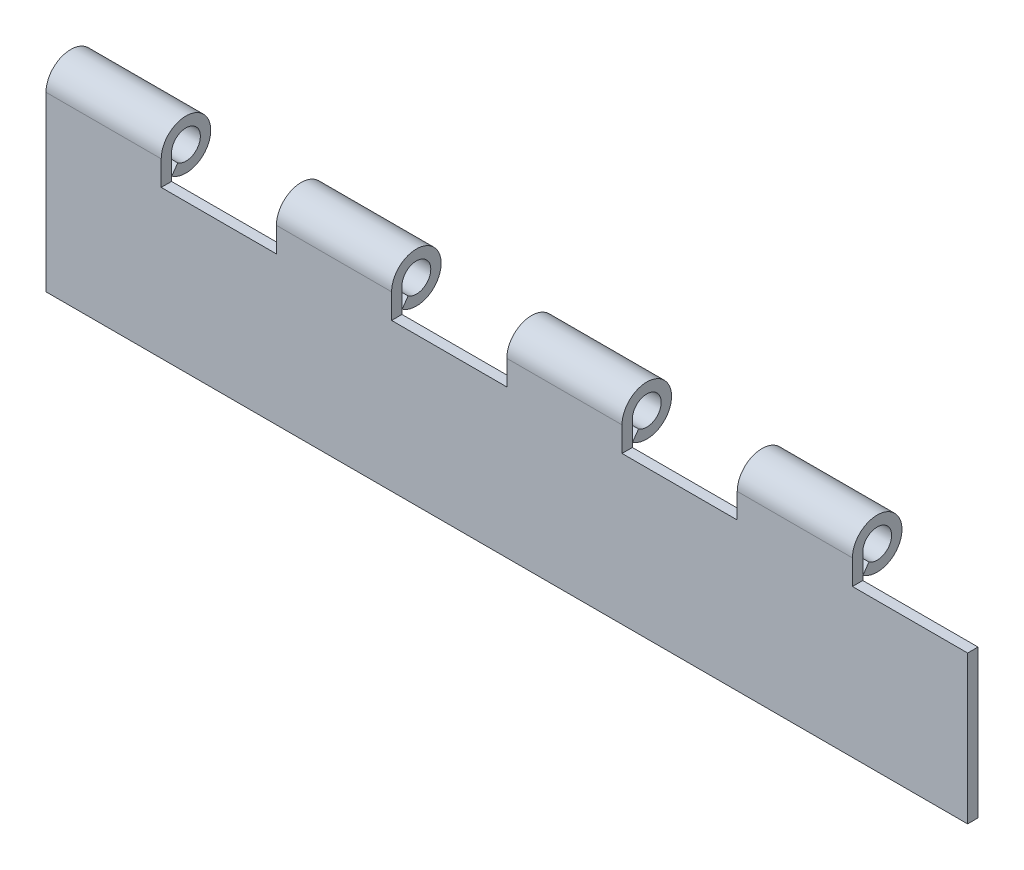
ISO-10303-21;
HEADER;
FILE_DESCRIPTION(('STEP AP214'),'2;1');
FILE_NAME('part.step','',(''),(''),'','','');
FILE_SCHEMA(('AUTOMOTIVE_DESIGN { 1 0 10303 214 1 1 1 1 }'));
ENDSEC;
DATA;
#1=APPLICATION_CONTEXT('core data for automotive mechanical design processes');
#2=APPLICATION_PROTOCOL_DEFINITION('international standard','automotive_design',2000,#1);
#3=PRODUCT_CONTEXT('',#1,'mechanical');
#4=PRODUCT('Part','Part','',(#3));
#5=PRODUCT_RELATED_PRODUCT_CATEGORY('part','',(#4));
#6=PRODUCT_DEFINITION_FORMATION('','',#4);
#7=PRODUCT_DEFINITION_CONTEXT('part definition',#1,'design');
#8=PRODUCT_DEFINITION('design','',#6,#7);
#9=PRODUCT_DEFINITION_SHAPE('','',#8);
#10=(LENGTH_UNIT() NAMED_UNIT(*) SI_UNIT(.MILLI.,.METRE.));
#11=(NAMED_UNIT(*) PLANE_ANGLE_UNIT() SI_UNIT($,.RADIAN.));
#12=(NAMED_UNIT(*) SI_UNIT($,.STERADIAN.) SOLID_ANGLE_UNIT());
#13=UNCERTAINTY_MEASURE_WITH_UNIT(LENGTH_MEASURE(1.E-05),#10,'distance_accuracy_value','');
#14=(GEOMETRIC_REPRESENTATION_CONTEXT(3) GLOBAL_UNCERTAINTY_ASSIGNED_CONTEXT((#13)) GLOBAL_UNIT_ASSIGNED_CONTEXT((#10,
#11,#12)) REPRESENTATION_CONTEXT('',''));
#15=CARTESIAN_POINT('',(0.,0.,0.));
#16=DIRECTION('',(0.,0.,1.));
#17=DIRECTION('',(1.,0.,0.));
#18=AXIS2_PLACEMENT_3D('',#15,#16,#17);
#19=CARTESIAN_POINT('',(-101.6,0.,-5.461));
#20=DIRECTION('',(1.,0.,0.));
#21=DIRECTION('',(0.,0.,-1.));
#22=AXIS2_PLACEMENT_3D('',#19,#20,#21);
#23=CYLINDRICAL_SURFACE('',#22,3.175);
#24=CARTESIAN_POINT('',(-101.6,0.,-5.461));
#25=DIRECTION('',(1.,0.,0.));
#26=DIRECTION('',(0.,0.,-1.));
#27=AXIS2_PLACEMENT_3D('',#24,#25,#26);
#28=CIRCLE('',#27,3.175);
#29=CARTESIAN_POINT('',(-101.6,0.,-2.286));
#30=VERTEX_POINT('',#29);
#31=CARTESIAN_POINT('',(-101.6,-2.60080774061703,-3.63989481458488));
#32=VERTEX_POINT('',#31);
#33=EDGE_CURVE('E266',#30,#32,#28,.F.);
#34=ORIENTED_EDGE('',*,*,#33,.T.);
#35=DIRECTION('',(1.,0.,0.));
#36=VECTOR('',#35,1.);
#37=CARTESIAN_POINT('',(-101.6,-2.60080774061694,-3.63989481458494));
#38=LINE('',#37,#36);
#39=CARTESIAN_POINT('',(-76.2,-2.60080774061703,-3.63989481458488));
#40=VERTEX_POINT('',#39);
#41=EDGE_CURVE('E143',#40,#32,#38,.F.);
#42=ORIENTED_EDGE('',*,*,#41,.F.);
#43=CARTESIAN_POINT('',(-76.2,0.,-5.461));
#44=DIRECTION('',(1.,0.,0.));
#45=DIRECTION('',(0.,0.,-1.));
#46=AXIS2_PLACEMENT_3D('',#43,#44,#45);
#47=CIRCLE('',#46,3.175);
#48=CARTESIAN_POINT('',(-76.2,0.,-2.286));
#49=VERTEX_POINT('',#48);
#50=EDGE_CURVE('E19',#40,#49,#47,.T.);
#51=ORIENTED_EDGE('',*,*,#50,.T.);
#52=DIRECTION('',(-1.,0.,0.));
#53=VECTOR('',#52,1.);
#54=CARTESIAN_POINT('',(-101.6,0.,-2.286));
#55=LINE('',#54,#53);
#56=EDGE_CURVE('E224',#30,#49,#55,.F.);
#57=ORIENTED_EDGE('',*,*,#56,.F.);
#58=EDGE_LOOP('',(#34,#42,#51,#57));
#59=FACE_BOUND('',#58,.T.);
#60=ADVANCED_FACE('F16',(#59),#23,.F.);
#61=CARTESIAN_POINT('',(-101.6,-2.60080774061694,-3.63989481458494));
#62=DIRECTION('',(0.,0.573576436351011,0.819152044289016));
#63=DIRECTION('',(0.,-0.819152044289016,0.573576436351011));
#64=AXIS2_PLACEMENT_3D('',#61,#62,#63);
#65=PLANE('',#64);
#66=DIRECTION('',(1.,0.,0.));
#67=VECTOR('',#66,1.);
#68=CARTESIAN_POINT('',(-101.6,-4.47338931386185,-2.32869908108645));
#69=LINE('',#68,#67);
#70=CARTESIAN_POINT('',(-76.2,-4.47338931386185,-2.32869908108645));
#71=VERTEX_POINT('',#70);
#72=CARTESIAN_POINT('',(-101.6,-4.47338931386185,-2.32869908108645));
#73=VERTEX_POINT('',#72);
#74=EDGE_CURVE('E270',#71,#73,#69,.F.);
#75=ORIENTED_EDGE('',*,*,#74,.F.);
#76=DIRECTION('',(0.,0.819152044289032,-0.573576436350989));
#77=VECTOR('',#76,1.);
#78=CARTESIAN_POINT('',(-76.2,-4.47338931386134,-2.32869908108681));
#79=LINE('',#78,#77);
#80=EDGE_CURVE('E278',#71,#40,#79,.T.);
#81=ORIENTED_EDGE('',*,*,#80,.T.);
#82=ORIENTED_EDGE('',*,*,#41,.T.);
#83=DIRECTION('',(0.,-0.819152044289032,0.573576436350989));
#84=VECTOR('',#83,1.);
#85=CARTESIAN_POINT('',(-101.6,-2.60080774061694,-3.63989481458494));
#86=LINE('',#85,#84);
#87=EDGE_CURVE('E265',#32,#73,#86,.T.);
#88=ORIENTED_EDGE('',*,*,#87,.T.);
#89=EDGE_LOOP('',(#75,#81,#82,#88));
#90=FACE_BOUND('',#89,.T.);
#91=ADVANCED_FACE('F595',(#90),#65,.T.);
#92=CARTESIAN_POINT('',(-101.6,0.,-5.461));
#93=DIRECTION('',(1.,0.,0.));
#94=DIRECTION('',(0.,0.,-1.));
#95=AXIS2_PLACEMENT_3D('',#92,#93,#94);
#96=CYLINDRICAL_SURFACE('',#95,3.175);
#97=CARTESIAN_POINT('',(76.2,0.,-5.461));
#98=DIRECTION('',(1.,0.,0.));
#99=DIRECTION('',(0.,0.,-1.));
#100=AXIS2_PLACEMENT_3D('',#97,#98,#99);
#101=CIRCLE('',#100,3.175);
#102=CARTESIAN_POINT('',(76.2,-2.60080774061703,-3.63989481458488));
#103=VERTEX_POINT('',#102);
#104=CARTESIAN_POINT('',(76.2,0.,-2.286));
#105=VERTEX_POINT('',#104);
#106=EDGE_CURVE('E258',#103,#105,#101,.T.);
#107=ORIENTED_EDGE('',*,*,#106,.T.);
#108=DIRECTION('',(-1.,0.,0.));
#109=VECTOR('',#108,1.);
#110=CARTESIAN_POINT('',(-101.6,0.,-2.286));
#111=LINE('',#110,#109);
#112=CARTESIAN_POINT('',(50.8,0.,-2.286));
#113=VERTEX_POINT('',#112);
#114=EDGE_CURVE('E297',#113,#105,#111,.F.);
#115=ORIENTED_EDGE('',*,*,#114,.F.);
#116=CARTESIAN_POINT('',(50.8,0.,-5.461));
#117=DIRECTION('',(1.,0.,0.));
#118=DIRECTION('',(0.,0.,-1.));
#119=AXIS2_PLACEMENT_3D('',#116,#117,#118);
#120=CIRCLE('',#119,3.175);
#121=CARTESIAN_POINT('',(50.8,-2.60080774061703,-3.63989481458488));
#122=VERTEX_POINT('',#121);
#123=EDGE_CURVE('E251',#113,#122,#120,.F.);
#124=ORIENTED_EDGE('',*,*,#123,.T.);
#125=DIRECTION('',(1.,0.,0.));
#126=VECTOR('',#125,1.);
#127=CARTESIAN_POINT('',(-101.6,-2.60080774061694,-3.63989481458494));
#128=LINE('',#127,#126);
#129=EDGE_CURVE('E282',#103,#122,#128,.F.);
#130=ORIENTED_EDGE('',*,*,#129,.F.);
#131=EDGE_LOOP('',(#107,#115,#124,#130));
#132=FACE_BOUND('',#131,.T.);
#133=ADVANCED_FACE('F585',(#132),#96,.F.);
#134=CARTESIAN_POINT('',(-101.6,-2.60080774061694,-3.63989481458494));
#135=DIRECTION('',(0.,0.573576436351011,0.819152044289016));
#136=DIRECTION('',(0.,-0.819152044289016,0.573576436351011));
#137=AXIS2_PLACEMENT_3D('',#134,#135,#136);
#138=PLANE('',#137);
#139=ORIENTED_EDGE('',*,*,#129,.T.);
#140=DIRECTION('',(0.,-0.819152044289032,0.573576436350989));
#141=VECTOR('',#140,1.);
#142=CARTESIAN_POINT('',(50.8,-2.60080774061694,-3.63989481458494));
#143=LINE('',#142,#141);
#144=CARTESIAN_POINT('',(50.8,-4.47338931386185,-2.32869908108645));
#145=VERTEX_POINT('',#144);
#146=EDGE_CURVE('E250',#122,#145,#143,.T.);
#147=ORIENTED_EDGE('',*,*,#146,.T.);
#148=DIRECTION('',(1.,0.,0.));
#149=VECTOR('',#148,1.);
#150=CARTESIAN_POINT('',(-101.6,-4.47338931386185,-2.32869908108645));
#151=LINE('',#150,#149);
#152=CARTESIAN_POINT('',(76.2,-4.47338931386185,-2.32869908108645));
#153=VERTEX_POINT('',#152);
#154=EDGE_CURVE('E257',#153,#145,#151,.F.);
#155=ORIENTED_EDGE('',*,*,#154,.F.);
#156=DIRECTION('',(0.,0.819152044289032,-0.573576436350989));
#157=VECTOR('',#156,1.);
#158=CARTESIAN_POINT('',(76.2,-4.47338931386134,-2.32869908108681));
#159=LINE('',#158,#157);
#160=EDGE_CURVE('E261',#153,#103,#159,.T.);
#161=ORIENTED_EDGE('',*,*,#160,.T.);
#162=EDGE_LOOP('',(#139,#147,#155,#161));
#163=FACE_BOUND('',#162,.T.);
#164=ADVANCED_FACE('F587',(#163),#138,.T.);
#165=CARTESIAN_POINT('',(-101.6,0.,-5.461));
#166=DIRECTION('',(1.,0.,0.));
#167=DIRECTION('',(0.,0.,-1.));
#168=AXIS2_PLACEMENT_3D('',#165,#166,#167);
#169=CYLINDRICAL_SURFACE('',#168,3.175);
#170=CARTESIAN_POINT('',(25.4,0.,-5.461));
#171=DIRECTION('',(1.,0.,0.));
#172=DIRECTION('',(0.,0.,-1.));
#173=AXIS2_PLACEMENT_3D('',#170,#171,#172);
#174=CIRCLE('',#173,3.175);
#175=CARTESIAN_POINT('',(25.4,-2.60080774061703,-3.63989481458488));
#176=VERTEX_POINT('',#175);
#177=CARTESIAN_POINT('',(25.4,0.,-2.286));
#178=VERTEX_POINT('',#177);
#179=EDGE_CURVE('E243',#176,#178,#174,.T.);
#180=ORIENTED_EDGE('',*,*,#179,.T.);
#181=DIRECTION('',(-1.,0.,0.));
#182=VECTOR('',#181,1.);
#183=CARTESIAN_POINT('',(-101.6,0.,-2.286));
#184=LINE('',#183,#182);
#185=CARTESIAN_POINT('',(0.,0.,-2.286));
#186=VERTEX_POINT('',#185);
#187=EDGE_CURVE('E292',#186,#178,#184,.F.);
#188=ORIENTED_EDGE('',*,*,#187,.F.);
#189=CARTESIAN_POINT('',(0.,0.,-5.461));
#190=DIRECTION('',(1.,0.,0.));
#191=DIRECTION('',(0.,0.,-1.));
#192=AXIS2_PLACEMENT_3D('',#189,#190,#191);
#193=CIRCLE('',#192,3.175);
#194=CARTESIAN_POINT('',(0.,-2.60080774061703,-3.63989481458488));
#195=VERTEX_POINT('',#194);
#196=EDGE_CURVE('E236',#186,#195,#193,.F.);
#197=ORIENTED_EDGE('',*,*,#196,.T.);
#198=DIRECTION('',(1.,0.,0.));
#199=VECTOR('',#198,1.);
#200=CARTESIAN_POINT('',(-101.6,-2.60080774061694,-3.63989481458494));
#201=LINE('',#200,#199);
#202=EDGE_CURVE('E286',#176,#195,#201,.F.);
#203=ORIENTED_EDGE('',*,*,#202,.F.);
#204=EDGE_LOOP('',(#180,#188,#197,#203));
#205=FACE_BOUND('',#204,.T.);
#206=ADVANCED_FACE('F535',(#205),#169,.F.);
#207=CARTESIAN_POINT('',(-101.6,-2.60080774061694,-3.63989481458494));
#208=DIRECTION('',(0.,0.573576436351011,0.819152044289016));
#209=DIRECTION('',(0.,-0.819152044289016,0.573576436351011));
#210=AXIS2_PLACEMENT_3D('',#207,#208,#209);
#211=PLANE('',#210);
#212=ORIENTED_EDGE('',*,*,#202,.T.);
#213=DIRECTION('',(0.,-0.819152044289032,0.573576436350989));
#214=VECTOR('',#213,1.);
#215=CARTESIAN_POINT('',(0.,-2.60080774061694,-3.63989481458494));
#216=LINE('',#215,#214);
#217=CARTESIAN_POINT('',(0.,-4.47338931386185,-2.32869908108645));
#218=VERTEX_POINT('',#217);
#219=EDGE_CURVE('E235',#195,#218,#216,.T.);
#220=ORIENTED_EDGE('',*,*,#219,.T.);
#221=DIRECTION('',(1.,0.,0.));
#222=VECTOR('',#221,1.);
#223=CARTESIAN_POINT('',(-101.6,-4.47338931386185,-2.32869908108645));
#224=LINE('',#223,#222);
#225=CARTESIAN_POINT('',(25.4,-4.47338931386185,-2.32869908108645));
#226=VERTEX_POINT('',#225);
#227=EDGE_CURVE('E242',#226,#218,#224,.F.);
#228=ORIENTED_EDGE('',*,*,#227,.F.);
#229=DIRECTION('',(0.,0.819152044289032,-0.573576436350989));
#230=VECTOR('',#229,1.);
#231=CARTESIAN_POINT('',(25.4,-4.47338931386134,-2.32869908108681));
#232=LINE('',#231,#230);
#233=EDGE_CURVE('E246',#226,#176,#232,.T.);
#234=ORIENTED_EDGE('',*,*,#233,.T.);
#235=EDGE_LOOP('',(#212,#220,#228,#234));
#236=FACE_BOUND('',#235,.T.);
#237=ADVANCED_FACE('F572',(#236),#211,.T.);
#238=CARTESIAN_POINT('',(-101.6,-38.1,-2.286));
#239=DIRECTION('',(0.,0.,-1.));
#240=DIRECTION('',(-1.,0.,0.));
#241=AXIS2_PLACEMENT_3D('',#238,#239,#240);
#242=PLANE('',#241);
#243=DIRECTION('',(1.,0.,0.));
#244=VECTOR('',#243,1.);
#245=CARTESIAN_POINT('',(-76.2,-5.461,-2.286));
#246=LINE('',#245,#244);
#247=CARTESIAN_POINT('',(-76.2,-5.461,-2.286));
#248=VERTEX_POINT('',#247);
#249=CARTESIAN_POINT('',(-50.8,-5.461,-2.286));
#250=VERTEX_POINT('',#249);
#251=EDGE_CURVE('E344',#248,#250,#246,.T.);
#252=ORIENTED_EDGE('',*,*,#251,.T.);
#253=DIRECTION('',(0.,1.,0.));
#254=VECTOR('',#253,1.);
#255=CARTESIAN_POINT('',(-50.8,-5.461,-2.286));
#256=LINE('',#255,#254);
#257=CARTESIAN_POINT('',(-50.8,0.,-2.286));
#258=VERTEX_POINT('',#257);
#259=EDGE_CURVE('E215',#250,#258,#256,.T.);
#260=ORIENTED_EDGE('',*,*,#259,.T.);
#261=DIRECTION('',(1.,0.,0.));
#262=VECTOR('',#261,1.);
#263=CARTESIAN_POINT('',(-101.6,0.,-2.286));
#264=LINE('',#263,#262);
#265=CARTESIAN_POINT('',(-25.4,0.,-2.286));
#266=VERTEX_POINT('',#265);
#267=EDGE_CURVE('E354',#258,#266,#264,.T.);
#268=ORIENTED_EDGE('',*,*,#267,.T.);
#269=DIRECTION('',(0.,1.,0.));
#270=VECTOR('',#269,1.);
#271=CARTESIAN_POINT('',(-25.4,5.461,-2.286));
#272=LINE('',#271,#270);
#273=CARTESIAN_POINT('',(-25.4,-5.461,-2.286));
#274=VERTEX_POINT('',#273);
#275=EDGE_CURVE('E481',#266,#274,#272,.F.);
#276=ORIENTED_EDGE('',*,*,#275,.T.);
#277=DIRECTION('',(1.,0.,0.));
#278=VECTOR('',#277,1.);
#279=CARTESIAN_POINT('',(-25.4,-5.461,-2.286));
#280=LINE('',#279,#278);
#281=CARTESIAN_POINT('',(0.,-5.461,-2.286));
#282=VERTEX_POINT('',#281);
#283=EDGE_CURVE('E234',#274,#282,#280,.T.);
#284=ORIENTED_EDGE('',*,*,#283,.T.);
#285=DIRECTION('',(0.,1.,0.));
#286=VECTOR('',#285,1.);
#287=CARTESIAN_POINT('',(0.,-5.461,-2.286));
#288=LINE('',#287,#286);
#289=EDGE_CURVE('E238',#282,#186,#288,.T.);
#290=ORIENTED_EDGE('',*,*,#289,.T.);
#291=ORIENTED_EDGE('',*,*,#187,.T.);
#292=DIRECTION('',(0.,1.,0.));
#293=VECTOR('',#292,1.);
#294=CARTESIAN_POINT('',(25.4,5.461,-2.286));
#295=LINE('',#294,#293);
#296=CARTESIAN_POINT('',(25.4,-5.461,-2.286));
#297=VERTEX_POINT('',#296);
#298=EDGE_CURVE('E368',#178,#297,#295,.F.);
#299=ORIENTED_EDGE('',*,*,#298,.T.);
#300=DIRECTION('',(1.,0.,0.));
#301=VECTOR('',#300,1.);
#302=CARTESIAN_POINT('',(25.4,-5.461,-2.286));
#303=LINE('',#302,#301);
#304=CARTESIAN_POINT('',(50.8,-5.461,-2.286));
#305=VERTEX_POINT('',#304);
#306=EDGE_CURVE('E249',#297,#305,#303,.T.);
#307=ORIENTED_EDGE('',*,*,#306,.T.);
#308=DIRECTION('',(0.,1.,0.));
#309=VECTOR('',#308,1.);
#310=CARTESIAN_POINT('',(50.8,-5.461,-2.286));
#311=LINE('',#310,#309);
#312=EDGE_CURVE('E253',#305,#113,#311,.T.);
#313=ORIENTED_EDGE('',*,*,#312,.T.);
#314=ORIENTED_EDGE('',*,*,#114,.T.);
#315=DIRECTION('',(0.,1.,0.));
#316=VECTOR('',#315,1.);
#317=CARTESIAN_POINT('',(76.2,5.461,-2.286));
#318=LINE('',#317,#316);
#319=CARTESIAN_POINT('',(76.2,-5.461,-2.286));
#320=VERTEX_POINT('',#319);
#321=EDGE_CURVE('E302',#105,#320,#318,.F.);
#322=ORIENTED_EDGE('',*,*,#321,.T.);
#323=DIRECTION('',(1.,0.,0.));
#324=VECTOR('',#323,1.);
#325=CARTESIAN_POINT('',(76.2,-5.461,-2.286));
#326=LINE('',#325,#324);
#327=CARTESIAN_POINT('',(101.6,-5.461,-2.286));
#328=VERTEX_POINT('',#327);
#329=EDGE_CURVE('E299',#320,#328,#326,.T.);
#330=ORIENTED_EDGE('',*,*,#329,.T.);
#331=DIRECTION('',(0.,1.,0.));
#332=VECTOR('',#331,1.);
#333=CARTESIAN_POINT('',(101.6,0.,-2.286));
#334=LINE('',#333,#332);
#335=CARTESIAN_POINT('',(101.6,-38.1,-2.286));
#336=VERTEX_POINT('',#335);
#337=EDGE_CURVE('E306',#336,#328,#334,.T.);
#338=ORIENTED_EDGE('',*,*,#337,.F.);
#339=DIRECTION('',(1.,0.,0.));
#340=VECTOR('',#339,1.);
#341=CARTESIAN_POINT('',(-101.6,-38.1,-2.286));
#342=LINE('',#341,#340);
#343=CARTESIAN_POINT('',(-101.6,-38.1,-2.286));
#344=VERTEX_POINT('',#343);
#345=EDGE_CURVE('E264',#344,#336,#342,.T.);
#346=ORIENTED_EDGE('',*,*,#345,.F.);
#347=DIRECTION('',(0.,1.,0.));
#348=VECTOR('',#347,1.);
#349=CARTESIAN_POINT('',(-101.6,0.,-2.286));
#350=LINE('',#349,#348);
#351=EDGE_CURVE('E267',#344,#30,#350,.T.);
#352=ORIENTED_EDGE('',*,*,#351,.T.);
#353=ORIENTED_EDGE('',*,*,#56,.T.);
#354=DIRECTION('',(0.,1.,0.));
#355=VECTOR('',#354,1.);
#356=CARTESIAN_POINT('',(-76.2,5.461,-2.286));
#357=LINE('',#356,#355);
#358=EDGE_CURVE('E150',#49,#248,#357,.F.);
#359=ORIENTED_EDGE('',*,*,#358,.T.);
#360=EDGE_LOOP('',(#252,#260,#268,#276,#284,#290,#291,#299,#307,#313,#314,#322,#330,#338,#346,
#352,#353,#359));
#361=FACE_BOUND('',#360,.T.);
#362=ADVANCED_FACE('F511',(#361),#242,.T.);
#363=CARTESIAN_POINT('',(-101.6,0.,-5.461));
#364=DIRECTION('',(1.,0.,0.));
#365=DIRECTION('',(0.,0.,-1.));
#366=AXIS2_PLACEMENT_3D('',#363,#364,#365);
#367=CYLINDRICAL_SURFACE('',#366,3.175);
#368=CARTESIAN_POINT('',(-25.4,0.,-5.461));
#369=DIRECTION('',(1.,0.,0.));
#370=DIRECTION('',(0.,0.,-1.));
#371=AXIS2_PLACEMENT_3D('',#368,#369,#370);
#372=CIRCLE('',#371,3.175);
#373=CARTESIAN_POINT('',(-25.4,-2.60080774061703,-3.63989481458488));
#374=VERTEX_POINT('',#373);
#375=EDGE_CURVE('E228',#374,#266,#372,.T.);
#376=ORIENTED_EDGE('',*,*,#375,.T.);
#377=ORIENTED_EDGE('',*,*,#267,.F.);
#378=CARTESIAN_POINT('',(-50.8,0.,-5.461));
#379=DIRECTION('',(1.,0.,0.));
#380=DIRECTION('',(0.,0.,-1.));
#381=AXIS2_PLACEMENT_3D('',#378,#379,#380);
#382=CIRCLE('',#381,3.175);
#383=CARTESIAN_POINT('',(-50.8,-2.60080774061703,-3.63989481458488));
#384=VERTEX_POINT('',#383);
#385=EDGE_CURVE('E211',#258,#384,#382,.F.);
#386=ORIENTED_EDGE('',*,*,#385,.T.);
#387=DIRECTION('',(1.,0.,0.));
#388=VECTOR('',#387,1.);
#389=CARTESIAN_POINT('',(-101.6,-2.60080774061694,-3.63989481458494));
#390=LINE('',#389,#388);
#391=EDGE_CURVE('E208',#374,#384,#390,.F.);
#392=ORIENTED_EDGE('',*,*,#391,.F.);
#393=EDGE_LOOP('',(#376,#377,#386,#392));
#394=FACE_BOUND('',#393,.T.);
#395=ADVANCED_FACE('F513',(#394),#367,.F.);
#396=CARTESIAN_POINT('',(-101.6,-2.60080774061694,-3.63989481458494));
#397=DIRECTION('',(0.,0.573576436351011,0.819152044289016));
#398=DIRECTION('',(0.,-0.819152044289016,0.573576436351011));
#399=AXIS2_PLACEMENT_3D('',#396,#397,#398);
#400=PLANE('',#399);
#401=ORIENTED_EDGE('',*,*,#391,.T.);
#402=DIRECTION('',(0.,-0.819152044289032,0.573576436350989));
#403=VECTOR('',#402,1.);
#404=CARTESIAN_POINT('',(-50.8,-2.60080774061694,-3.63989481458494));
#405=LINE('',#404,#403);
#406=CARTESIAN_POINT('',(-50.8,-4.47338931386185,-2.32869908108645));
#407=VERTEX_POINT('',#406);
#408=EDGE_CURVE('E203',#384,#407,#405,.T.);
#409=ORIENTED_EDGE('',*,*,#408,.T.);
#410=DIRECTION('',(1.,0.,0.));
#411=VECTOR('',#410,1.);
#412=CARTESIAN_POINT('',(-101.6,-4.47338931386185,-2.32869908108645));
#413=LINE('',#412,#411);
#414=CARTESIAN_POINT('',(-25.4,-4.47338931386185,-2.32869908108645));
#415=VERTEX_POINT('',#414);
#416=EDGE_CURVE('E206',#415,#407,#413,.F.);
#417=ORIENTED_EDGE('',*,*,#416,.F.);
#418=DIRECTION('',(0.,0.819152044289032,-0.573576436350989));
#419=VECTOR('',#418,1.);
#420=CARTESIAN_POINT('',(-25.4,-4.47338931386134,-2.32869908108681));
#421=LINE('',#420,#419);
#422=EDGE_CURVE('E231',#415,#374,#421,.T.);
#423=ORIENTED_EDGE('',*,*,#422,.T.);
#424=EDGE_LOOP('',(#401,#409,#417,#423));
#425=FACE_BOUND('',#424,.T.);
#426=ADVANCED_FACE('F204',(#425),#400,.T.);
#427=CARTESIAN_POINT('',(-76.2,-5.461,0.));
#428=DIRECTION('',(0.,-1.,0.));
#429=DIRECTION('',(0.,0.,-1.));
#430=AXIS2_PLACEMENT_3D('',#427,#428,#429);
#431=PLANE('',#430);
#432=DIRECTION('',(1.,0.,0.));
#433=VECTOR('',#432,1.);
#434=CARTESIAN_POINT('',(-101.6,-5.461,0.));
#435=LINE('',#434,#433);
#436=CARTESIAN_POINT('',(-50.8,-5.461,0.));
#437=VERTEX_POINT('',#436);
#438=CARTESIAN_POINT('',(-76.2,-5.461,0.));
#439=VERTEX_POINT('',#438);
#440=EDGE_CURVE('E196',#437,#439,#435,.F.);
#441=ORIENTED_EDGE('',*,*,#440,.F.);
#442=DIRECTION('',(0.,0.,-1.));
#443=VECTOR('',#442,1.);
#444=CARTESIAN_POINT('',(-50.8,-5.461,0.));
#445=LINE('',#444,#443);
#446=EDGE_CURVE('E219',#437,#250,#445,.T.);
#447=ORIENTED_EDGE('',*,*,#446,.T.);
#448=ORIENTED_EDGE('',*,*,#251,.F.);
#449=DIRECTION('',(0.,0.,1.));
#450=VECTOR('',#449,1.);
#451=CARTESIAN_POINT('',(-76.2,-5.461,0.));
#452=LINE('',#451,#450);
#453=EDGE_CURVE('E342',#248,#439,#452,.T.);
#454=ORIENTED_EDGE('',*,*,#453,.T.);
#455=EDGE_LOOP('',(#441,#447,#448,#454));
#456=FACE_BOUND('',#455,.T.);
#457=ADVANCED_FACE('F661',(#456),#431,.F.);
#458=CARTESIAN_POINT('',(-76.2,5.461,0.));
#459=DIRECTION('',(-1.,0.,0.));
#460=DIRECTION('',(0.,0.,1.));
#461=AXIS2_PLACEMENT_3D('',#458,#459,#460);
#462=PLANE('',#461);
#463=ORIENTED_EDGE('',*,*,#80,.F.);
#464=CARTESIAN_POINT('',(-76.2,0.,-5.461));
#465=DIRECTION('',(1.,0.,0.));
#466=DIRECTION('',(0.,0.,-1.));
#467=AXIS2_PLACEMENT_3D('',#464,#465,#466);
#468=CIRCLE('',#467,5.461);
#469=CARTESIAN_POINT('',(-76.2,0.,0.));
#470=VERTEX_POINT('',#469);
#471=EDGE_CURVE('E268',#470,#71,#468,.F.);
#472=ORIENTED_EDGE('',*,*,#471,.F.);
#473=DIRECTION('',(0.,1.,0.));
#474=VECTOR('',#473,1.);
#475=CARTESIAN_POINT('',(-76.2,0.,0.));
#476=LINE('',#475,#474);
#477=EDGE_CURVE('E336',#439,#470,#476,.T.);
#478=ORIENTED_EDGE('',*,*,#477,.F.);
#479=ORIENTED_EDGE('',*,*,#453,.F.);
#480=ORIENTED_EDGE('',*,*,#358,.F.);
#481=ORIENTED_EDGE('',*,*,#50,.F.);
#482=EDGE_LOOP('',(#463,#472,#478,#479,#480,#481));
#483=FACE_BOUND('',#482,.T.);
#484=ADVANCED_FACE('F577',(#483),#462,.F.);
#485=CARTESIAN_POINT('',(-101.6,0.,-5.461));
#486=DIRECTION('',(1.,0.,0.));
#487=DIRECTION('',(0.,0.,-1.));
#488=AXIS2_PLACEMENT_3D('',#485,#486,#487);
#489=CYLINDRICAL_SURFACE('',#488,5.461);
#490=DIRECTION('',(1.,0.,0.));
#491=VECTOR('',#490,1.);
#492=CARTESIAN_POINT('',(-101.6,0.,0.));
#493=LINE('',#492,#491);
#494=CARTESIAN_POINT('',(-101.6,0.,0.));
#495=VERTEX_POINT('',#494);
#496=EDGE_CURVE('E328',#470,#495,#493,.F.);
#497=ORIENTED_EDGE('',*,*,#496,.F.);
#498=ORIENTED_EDGE('',*,*,#471,.T.);
#499=ORIENTED_EDGE('',*,*,#74,.T.);
#500=CARTESIAN_POINT('',(-101.6,0.,-5.461));
#501=DIRECTION('',(1.,0.,0.));
#502=DIRECTION('',(0.,0.,-1.));
#503=AXIS2_PLACEMENT_3D('',#500,#501,#502);
#504=CIRCLE('',#503,5.461);
#505=EDGE_CURVE('E262',#73,#495,#504,.T.);
#506=ORIENTED_EDGE('',*,*,#505,.T.);
#507=EDGE_LOOP('',(#497,#498,#499,#506));
#508=FACE_BOUND('',#507,.T.);
#509=ADVANCED_FACE('F579',(#508),#489,.T.);
#510=CARTESIAN_POINT('',(-101.6,0.,0.));
#511=DIRECTION('',(1.,0.,0.));
#512=DIRECTION('',(0.,0.,-1.));
#513=AXIS2_PLACEMENT_3D('',#510,#511,#512);
#514=PLANE('',#513);
#515=ORIENTED_EDGE('',*,*,#505,.F.);
#516=ORIENTED_EDGE('',*,*,#87,.F.);
#517=ORIENTED_EDGE('',*,*,#33,.F.);
#518=ORIENTED_EDGE('',*,*,#351,.F.);
#519=DIRECTION('',(0.,0.,-1.));
#520=VECTOR('',#519,1.);
#521=CARTESIAN_POINT('',(-101.6,-38.1,0.));
#522=LINE('',#521,#520);
#523=CARTESIAN_POINT('',(-101.6,-38.1,0.));
#524=VERTEX_POINT('',#523);
#525=EDGE_CURVE('E310',#524,#344,#522,.T.);
#526=ORIENTED_EDGE('',*,*,#525,.F.);
#527=DIRECTION('',(0.,1.,0.));
#528=VECTOR('',#527,1.);
#529=CARTESIAN_POINT('',(-101.6,0.,0.));
#530=LINE('',#529,#528);
#531=EDGE_CURVE('E324',#495,#524,#530,.F.);
#532=ORIENTED_EDGE('',*,*,#531,.F.);
#533=EDGE_LOOP('',(#515,#516,#517,#518,#526,#532));
#534=FACE_BOUND('',#533,.T.);
#535=ADVANCED_FACE('F581',(#534),#514,.F.);
#536=CARTESIAN_POINT('',(-101.6,-38.1,0.));
#537=DIRECTION('',(0.,-1.,0.));
#538=DIRECTION('',(0.,0.,-1.));
#539=AXIS2_PLACEMENT_3D('',#536,#537,#538);
#540=PLANE('',#539);
#541=DIRECTION('',(1.,0.,0.));
#542=VECTOR('',#541,1.);
#543=CARTESIAN_POINT('',(-101.6,-38.1,0.));
#544=LINE('',#543,#542);
#545=CARTESIAN_POINT('',(101.6,-38.1,0.));
#546=VERTEX_POINT('',#545);
#547=EDGE_CURVE('E327',#524,#546,#544,.T.);
#548=ORIENTED_EDGE('',*,*,#547,.F.);
#549=ORIENTED_EDGE('',*,*,#525,.T.);
#550=ORIENTED_EDGE('',*,*,#345,.T.);
#551=DIRECTION('',(0.,0.,-1.));
#552=VECTOR('',#551,1.);
#553=CARTESIAN_POINT('',(101.6,-38.1,0.));
#554=LINE('',#553,#552);
#555=EDGE_CURVE('E308',#546,#336,#554,.T.);
#556=ORIENTED_EDGE('',*,*,#555,.F.);
#557=EDGE_LOOP('',(#548,#549,#550,#556));
#558=FACE_BOUND('',#557,.T.);
#559=ADVANCED_FACE('F427',(#558),#540,.T.);
#560=CARTESIAN_POINT('',(101.6,0.,0.));
#561=DIRECTION('',(1.,0.,0.));
#562=DIRECTION('',(0.,0.,-1.));
#563=AXIS2_PLACEMENT_3D('',#560,#561,#562);
#564=PLANE('',#563);
#565=ORIENTED_EDGE('',*,*,#337,.T.);
#566=DIRECTION('',(0.,0.,-1.));
#567=VECTOR('',#566,1.);
#568=CARTESIAN_POINT('',(101.6,-5.461,0.));
#569=LINE('',#568,#567);
#570=CARTESIAN_POINT('',(101.6,-5.461,0.));
#571=VERTEX_POINT('',#570);
#572=EDGE_CURVE('E303',#328,#571,#569,.F.);
#573=ORIENTED_EDGE('',*,*,#572,.T.);
#574=DIRECTION('',(0.,1.,0.));
#575=VECTOR('',#574,1.);
#576=CARTESIAN_POINT('',(101.6,0.,0.));
#577=LINE('',#576,#575);
#578=EDGE_CURVE('E411',#546,#571,#577,.T.);
#579=ORIENTED_EDGE('',*,*,#578,.F.);
#580=ORIENTED_EDGE('',*,*,#555,.T.);
#581=EDGE_LOOP('',(#565,#573,#579,#580));
#582=FACE_BOUND('',#581,.T.);
#583=ADVANCED_FACE('F429',(#582),#564,.T.);
#584=CARTESIAN_POINT('',(76.2,-5.461,0.));
#585=DIRECTION('',(0.,-1.,0.));
#586=DIRECTION('',(0.,0.,-1.));
#587=AXIS2_PLACEMENT_3D('',#584,#585,#586);
#588=PLANE('',#587);
#589=DIRECTION('',(0.,0.,1.));
#590=VECTOR('',#589,1.);
#591=CARTESIAN_POINT('',(76.2,-5.461,0.));
#592=LINE('',#591,#590);
#593=CARTESIAN_POINT('',(76.2,-5.461,0.));
#594=VERTEX_POINT('',#593);
#595=EDGE_CURVE('E402',#320,#594,#592,.T.);
#596=ORIENTED_EDGE('',*,*,#595,.T.);
#597=DIRECTION('',(1.,0.,0.));
#598=VECTOR('',#597,1.);
#599=CARTESIAN_POINT('',(-101.6,-5.461,0.));
#600=LINE('',#599,#598);
#601=EDGE_CURVE('E398',#571,#594,#600,.F.);
#602=ORIENTED_EDGE('',*,*,#601,.F.);
#603=ORIENTED_EDGE('',*,*,#572,.F.);
#604=ORIENTED_EDGE('',*,*,#329,.F.);
#605=EDGE_LOOP('',(#596,#602,#603,#604));
#606=FACE_BOUND('',#605,.T.);
#607=ADVANCED_FACE('F434',(#606),#588,.F.);
#608=CARTESIAN_POINT('',(76.2,5.461,0.));
#609=DIRECTION('',(-1.,0.,0.));
#610=DIRECTION('',(0.,0.,1.));
#611=AXIS2_PLACEMENT_3D('',#608,#609,#610);
#612=PLANE('',#611);
#613=ORIENTED_EDGE('',*,*,#160,.F.);
#614=CARTESIAN_POINT('',(76.2,0.,-5.461));
#615=DIRECTION('',(1.,0.,0.));
#616=DIRECTION('',(0.,0.,-1.));
#617=AXIS2_PLACEMENT_3D('',#614,#615,#616);
#618=CIRCLE('',#617,5.461);
#619=CARTESIAN_POINT('',(76.2,0.,0.));
#620=VERTEX_POINT('',#619);
#621=EDGE_CURVE('E254',#620,#153,#618,.F.);
#622=ORIENTED_EDGE('',*,*,#621,.F.);
#623=DIRECTION('',(0.,1.,0.));
#624=VECTOR('',#623,1.);
#625=CARTESIAN_POINT('',(76.2,0.,0.));
#626=LINE('',#625,#624);
#627=EDGE_CURVE('E395',#594,#620,#626,.T.);
#628=ORIENTED_EDGE('',*,*,#627,.F.);
#629=ORIENTED_EDGE('',*,*,#595,.F.);
#630=ORIENTED_EDGE('',*,*,#321,.F.);
#631=ORIENTED_EDGE('',*,*,#106,.F.);
#632=EDGE_LOOP('',(#613,#622,#628,#629,#630,#631));
#633=FACE_BOUND('',#632,.T.);
#634=ADVANCED_FACE('F439',(#633),#612,.F.);
#635=CARTESIAN_POINT('',(-101.6,0.,-5.461));
#636=DIRECTION('',(1.,0.,0.));
#637=DIRECTION('',(0.,0.,-1.));
#638=AXIS2_PLACEMENT_3D('',#635,#636,#637);
#639=CYLINDRICAL_SURFACE('',#638,5.461);
#640=ORIENTED_EDGE('',*,*,#154,.T.);
#641=CARTESIAN_POINT('',(50.8,0.,-5.461));
#642=DIRECTION('',(1.,0.,0.));
#643=DIRECTION('',(0.,0.,-1.));
#644=AXIS2_PLACEMENT_3D('',#641,#642,#643);
#645=CIRCLE('',#644,5.461);
#646=CARTESIAN_POINT('',(50.8,0.,0.));
#647=VERTEX_POINT('',#646);
#648=EDGE_CURVE('E247',#145,#647,#645,.T.);
#649=ORIENTED_EDGE('',*,*,#648,.T.);
#650=DIRECTION('',(1.,0.,0.));
#651=VECTOR('',#650,1.);
#652=CARTESIAN_POINT('',(-101.6,0.,0.));
#653=LINE('',#652,#651);
#654=EDGE_CURVE('E386',#620,#647,#653,.F.);
#655=ORIENTED_EDGE('',*,*,#654,.F.);
#656=ORIENTED_EDGE('',*,*,#621,.T.);
#657=EDGE_LOOP('',(#640,#649,#655,#656));
#658=FACE_BOUND('',#657,.T.);
#659=ADVANCED_FACE('F445',(#658),#639,.T.);
#660=CARTESIAN_POINT('',(50.8,-5.461,0.));
#661=DIRECTION('',(1.,0.,0.));
#662=DIRECTION('',(0.,0.,-1.));
#663=AXIS2_PLACEMENT_3D('',#660,#661,#662);
#664=PLANE('',#663);
#665=DIRECTION('',(0.,1.,0.));
#666=VECTOR('',#665,1.);
#667=CARTESIAN_POINT('',(50.8,0.,0.));
#668=LINE('',#667,#666);
#669=CARTESIAN_POINT('',(50.8,-5.461,0.));
#670=VERTEX_POINT('',#669);
#671=EDGE_CURVE('E382',#647,#670,#668,.F.);
#672=ORIENTED_EDGE('',*,*,#671,.F.);
#673=ORIENTED_EDGE('',*,*,#648,.F.);
#674=ORIENTED_EDGE('',*,*,#146,.F.);
#675=ORIENTED_EDGE('',*,*,#123,.F.);
#676=ORIENTED_EDGE('',*,*,#312,.F.);
#677=DIRECTION('',(0.,0.,-1.));
#678=VECTOR('',#677,1.);
#679=CARTESIAN_POINT('',(50.8,-5.461,0.));
#680=LINE('',#679,#678);
#681=EDGE_CURVE('E363',#305,#670,#680,.F.);
#682=ORIENTED_EDGE('',*,*,#681,.T.);
#683=EDGE_LOOP('',(#672,#673,#674,#675,#676,#682));
#684=FACE_BOUND('',#683,.T.);
#685=ADVANCED_FACE('F447',(#684),#664,.F.);
#686=CARTESIAN_POINT('',(25.4,-5.461,0.));
#687=DIRECTION('',(0.,-1.,0.));
#688=DIRECTION('',(0.,0.,-1.));
#689=AXIS2_PLACEMENT_3D('',#686,#687,#688);
#690=PLANE('',#689);
#691=DIRECTION('',(1.,0.,0.));
#692=VECTOR('',#691,1.);
#693=CARTESIAN_POINT('',(-101.6,-5.461,0.));
#694=LINE('',#693,#692);
#695=CARTESIAN_POINT('',(25.4,-5.461,0.));
#696=VERTEX_POINT('',#695);
#697=EDGE_CURVE('E385',#670,#696,#694,.F.);
#698=ORIENTED_EDGE('',*,*,#697,.F.);
#699=ORIENTED_EDGE('',*,*,#681,.F.);
#700=ORIENTED_EDGE('',*,*,#306,.F.);
#701=DIRECTION('',(0.,0.,1.));
#702=VECTOR('',#701,1.);
#703=CARTESIAN_POINT('',(25.4,-5.461,0.));
#704=LINE('',#703,#702);
#705=EDGE_CURVE('E374',#297,#696,#704,.T.);
#706=ORIENTED_EDGE('',*,*,#705,.T.);
#707=EDGE_LOOP('',(#698,#699,#700,#706));
#708=FACE_BOUND('',#707,.T.);
#709=ADVANCED_FACE('F539',(#708),#690,.F.);
#710=CARTESIAN_POINT('',(25.4,5.461,0.));
#711=DIRECTION('',(-1.,0.,0.));
#712=DIRECTION('',(0.,0.,1.));
#713=AXIS2_PLACEMENT_3D('',#710,#711,#712);
#714=PLANE('',#713);
#715=ORIENTED_EDGE('',*,*,#233,.F.);
#716=CARTESIAN_POINT('',(25.4,0.,-5.461));
#717=DIRECTION('',(1.,0.,0.));
#718=DIRECTION('',(0.,0.,-1.));
#719=AXIS2_PLACEMENT_3D('',#716,#717,#718);
#720=CIRCLE('',#719,5.461);
#721=CARTESIAN_POINT('',(25.4,0.,0.));
#722=VERTEX_POINT('',#721);
#723=EDGE_CURVE('E239',#722,#226,#720,.F.);
#724=ORIENTED_EDGE('',*,*,#723,.F.);
#725=DIRECTION('',(0.,1.,0.));
#726=VECTOR('',#725,1.);
#727=CARTESIAN_POINT('',(25.4,0.,0.));
#728=LINE('',#727,#726);
#729=EDGE_CURVE('E452',#696,#722,#728,.T.);
#730=ORIENTED_EDGE('',*,*,#729,.F.);
#731=ORIENTED_EDGE('',*,*,#705,.F.);
#732=ORIENTED_EDGE('',*,*,#298,.F.);
#733=ORIENTED_EDGE('',*,*,#179,.F.);
#734=EDGE_LOOP('',(#715,#724,#730,#731,#732,#733));
#735=FACE_BOUND('',#734,.T.);
#736=ADVANCED_FACE('F538',(#735),#714,.F.);
#737=CARTESIAN_POINT('',(-101.6,0.,-5.461));
#738=DIRECTION('',(1.,0.,0.));
#739=DIRECTION('',(0.,0.,-1.));
#740=AXIS2_PLACEMENT_3D('',#737,#738,#739);
#741=CYLINDRICAL_SURFACE('',#740,5.461);
#742=ORIENTED_EDGE('',*,*,#227,.T.);
#743=CARTESIAN_POINT('',(0.,0.,-5.461));
#744=DIRECTION('',(1.,0.,0.));
#745=DIRECTION('',(0.,0.,-1.));
#746=AXIS2_PLACEMENT_3D('',#743,#744,#745);
#747=CIRCLE('',#746,5.461);
#748=CARTESIAN_POINT('',(0.,0.,0.));
#749=VERTEX_POINT('',#748);
#750=EDGE_CURVE('E232',#218,#749,#747,.T.);
#751=ORIENTED_EDGE('',*,*,#750,.T.);
#752=DIRECTION('',(1.,0.,0.));
#753=VECTOR('',#752,1.);
#754=CARTESIAN_POINT('',(-101.6,0.,0.));
#755=LINE('',#754,#753);
#756=EDGE_CURVE('E454',#722,#749,#755,.F.);
#757=ORIENTED_EDGE('',*,*,#756,.F.);
#758=ORIENTED_EDGE('',*,*,#723,.T.);
#759=EDGE_LOOP('',(#742,#751,#757,#758));
#760=FACE_BOUND('',#759,.T.);
#761=ADVANCED_FACE('F547',(#760),#741,.T.);
#762=CARTESIAN_POINT('',(0.,-5.461,0.));
#763=DIRECTION('',(1.,0.,0.));
#764=DIRECTION('',(0.,0.,-1.));
#765=AXIS2_PLACEMENT_3D('',#762,#763,#764);
#766=PLANE('',#765);
#767=DIRECTION('',(0.,1.,0.));
#768=VECTOR('',#767,1.);
#769=CARTESIAN_POINT('',(0.,0.,0.));
#770=LINE('',#769,#768);
#771=CARTESIAN_POINT('',(0.,-5.461,0.));
#772=VERTEX_POINT('',#771);
#773=EDGE_CURVE('E467',#749,#772,#770,.F.);
#774=ORIENTED_EDGE('',*,*,#773,.F.);
#775=ORIENTED_EDGE('',*,*,#750,.F.);
#776=ORIENTED_EDGE('',*,*,#219,.F.);
#777=ORIENTED_EDGE('',*,*,#196,.F.);
#778=ORIENTED_EDGE('',*,*,#289,.F.);
#779=DIRECTION('',(0.,0.,-1.));
#780=VECTOR('',#779,1.);
#781=CARTESIAN_POINT('',(0.,-5.461,0.));
#782=LINE('',#781,#780);
#783=EDGE_CURVE('E357',#282,#772,#782,.F.);
#784=ORIENTED_EDGE('',*,*,#783,.T.);
#785=EDGE_LOOP('',(#774,#775,#776,#777,#778,#784));
#786=FACE_BOUND('',#785,.T.);
#787=ADVANCED_FACE('F528',(#786),#766,.F.);
#788=CARTESIAN_POINT('',(-25.4,-5.461,0.));
#789=DIRECTION('',(0.,-1.,0.));
#790=DIRECTION('',(0.,0.,-1.));
#791=AXIS2_PLACEMENT_3D('',#788,#789,#790);
#792=PLANE('',#791);
#793=DIRECTION('',(1.,0.,0.));
#794=VECTOR('',#793,1.);
#795=CARTESIAN_POINT('',(-101.6,-5.461,0.));
#796=LINE('',#795,#794);
#797=CARTESIAN_POINT('',(-25.4,-5.461,0.));
#798=VERTEX_POINT('',#797);
#799=EDGE_CURVE('E477',#772,#798,#796,.F.);
#800=ORIENTED_EDGE('',*,*,#799,.F.);
#801=ORIENTED_EDGE('',*,*,#783,.F.);
#802=ORIENTED_EDGE('',*,*,#283,.F.);
#803=DIRECTION('',(0.,0.,1.));
#804=VECTOR('',#803,1.);
#805=CARTESIAN_POINT('',(-25.4,-5.461,0.));
#806=LINE('',#805,#804);
#807=EDGE_CURVE('E489',#274,#798,#806,.T.);
#808=ORIENTED_EDGE('',*,*,#807,.T.);
#809=EDGE_LOOP('',(#800,#801,#802,#808));
#810=FACE_BOUND('',#809,.T.);
#811=ADVANCED_FACE('F525',(#810),#792,.F.);
#812=CARTESIAN_POINT('',(-25.4,5.461,0.));
#813=DIRECTION('',(-1.,0.,0.));
#814=DIRECTION('',(0.,0.,1.));
#815=AXIS2_PLACEMENT_3D('',#812,#813,#814);
#816=PLANE('',#815);
#817=ORIENTED_EDGE('',*,*,#422,.F.);
#818=CARTESIAN_POINT('',(-25.4,0.,-5.461));
#819=DIRECTION('',(1.,0.,0.));
#820=DIRECTION('',(0.,0.,-1.));
#821=AXIS2_PLACEMENT_3D('',#818,#819,#820);
#822=CIRCLE('',#821,5.461);
#823=CARTESIAN_POINT('',(-25.4,0.,0.));
#824=VERTEX_POINT('',#823);
#825=EDGE_CURVE('E214',#824,#415,#822,.F.);
#826=ORIENTED_EDGE('',*,*,#825,.F.);
#827=DIRECTION('',(0.,1.,0.));
#828=VECTOR('',#827,1.);
#829=CARTESIAN_POINT('',(-25.4,0.,0.));
#830=LINE('',#829,#828);
#831=EDGE_CURVE('E486',#798,#824,#830,.T.);
#832=ORIENTED_EDGE('',*,*,#831,.F.);
#833=ORIENTED_EDGE('',*,*,#807,.F.);
#834=ORIENTED_EDGE('',*,*,#275,.F.);
#835=ORIENTED_EDGE('',*,*,#375,.F.);
#836=EDGE_LOOP('',(#817,#826,#832,#833,#834,#835));
#837=FACE_BOUND('',#836,.T.);
#838=ADVANCED_FACE('F518',(#837),#816,.F.);
#839=CARTESIAN_POINT('',(-101.6,0.,-5.461));
#840=DIRECTION('',(1.,0.,0.));
#841=DIRECTION('',(0.,0.,-1.));
#842=AXIS2_PLACEMENT_3D('',#839,#840,#841);
#843=CYLINDRICAL_SURFACE('',#842,5.461);
#844=ORIENTED_EDGE('',*,*,#416,.T.);
#845=CARTESIAN_POINT('',(-50.8,0.,-5.461));
#846=DIRECTION('',(1.,0.,0.));
#847=DIRECTION('',(0.,0.,-1.));
#848=AXIS2_PLACEMENT_3D('',#845,#846,#847);
#849=CIRCLE('',#848,5.461);
#850=CARTESIAN_POINT('',(-50.8,0.,0.));
#851=VERTEX_POINT('',#850);
#852=EDGE_CURVE('E34',#407,#851,#849,.T.);
#853=ORIENTED_EDGE('',*,*,#852,.T.);
#854=DIRECTION('',(1.,0.,0.));
#855=VECTOR('',#854,1.);
#856=CARTESIAN_POINT('',(-101.6,0.,0.));
#857=LINE('',#856,#855);
#858=EDGE_CURVE('E25',#824,#851,#857,.F.);
#859=ORIENTED_EDGE('',*,*,#858,.F.);
#860=ORIENTED_EDGE('',*,*,#825,.T.);
#861=EDGE_LOOP('',(#844,#853,#859,#860));
#862=FACE_BOUND('',#861,.T.);
#863=ADVANCED_FACE('F213',(#862),#843,.T.);
#864=CARTESIAN_POINT('',(-50.8,-5.461,0.));
#865=DIRECTION('',(1.,0.,0.));
#866=DIRECTION('',(0.,0.,-1.));
#867=AXIS2_PLACEMENT_3D('',#864,#865,#866);
#868=PLANE('',#867);
#869=DIRECTION('',(0.,1.,0.));
#870=VECTOR('',#869,1.);
#871=CARTESIAN_POINT('',(-50.8,0.,0.));
#872=LINE('',#871,#870);
#873=EDGE_CURVE('E11',#851,#437,#872,.F.);
#874=ORIENTED_EDGE('',*,*,#873,.F.);
#875=ORIENTED_EDGE('',*,*,#852,.F.);
#876=ORIENTED_EDGE('',*,*,#408,.F.);
#877=ORIENTED_EDGE('',*,*,#385,.F.);
#878=ORIENTED_EDGE('',*,*,#259,.F.);
#879=ORIENTED_EDGE('',*,*,#446,.F.);
#880=EDGE_LOOP('',(#874,#875,#876,#877,#878,#879));
#881=FACE_BOUND('',#880,.T.);
#882=ADVANCED_FACE('F217',(#881),#868,.F.);
#883=CARTESIAN_POINT('',(-101.6,0.,0.));
#884=DIRECTION('',(0.,0.,1.));
#885=DIRECTION('',(1.,0.,0.));
#886=AXIS2_PLACEMENT_3D('',#883,#884,#885);
#887=PLANE('',#886);
#888=ORIENTED_EDGE('',*,*,#858,.T.);
#889=ORIENTED_EDGE('',*,*,#873,.T.);
#890=ORIENTED_EDGE('',*,*,#440,.T.);
#891=ORIENTED_EDGE('',*,*,#477,.T.);
#892=ORIENTED_EDGE('',*,*,#496,.T.);
#893=ORIENTED_EDGE('',*,*,#531,.T.);
#894=ORIENTED_EDGE('',*,*,#547,.T.);
#895=ORIENTED_EDGE('',*,*,#578,.T.);
#896=ORIENTED_EDGE('',*,*,#601,.T.);
#897=ORIENTED_EDGE('',*,*,#627,.T.);
#898=ORIENTED_EDGE('',*,*,#654,.T.);
#899=ORIENTED_EDGE('',*,*,#671,.T.);
#900=ORIENTED_EDGE('',*,*,#697,.T.);
#901=ORIENTED_EDGE('',*,*,#729,.T.);
#902=ORIENTED_EDGE('',*,*,#756,.T.);
#903=ORIENTED_EDGE('',*,*,#773,.T.);
#904=ORIENTED_EDGE('',*,*,#799,.T.);
#905=ORIENTED_EDGE('',*,*,#831,.T.);
#906=EDGE_LOOP('',(#888,#889,#890,#891,#892,#893,#894,#895,#896,#897,#898,#899,#900,#901,#902,
#903,#904,#905));
#907=FACE_BOUND('',#906,.T.);
#908=ADVANCED_FACE('F424',(#907),#887,.T.);
#909=CLOSED_SHELL('',(#60,#91,#133,#164,#206,#237,#362,#395,#426,#457,#484,#509,#535,#559,#583,
#607,#634,#659,#685,#709,#736,#761,#787,#811,#838,#863,#882,#908));
#910=MANIFOLD_SOLID_BREP('B1',#909);
#911=ADVANCED_BREP_SHAPE_REPRESENTATION('',(#18,#910),#14);
#912=SHAPE_DEFINITION_REPRESENTATION(#9,#911);
ENDSEC;
END-ISO-10303-21;
